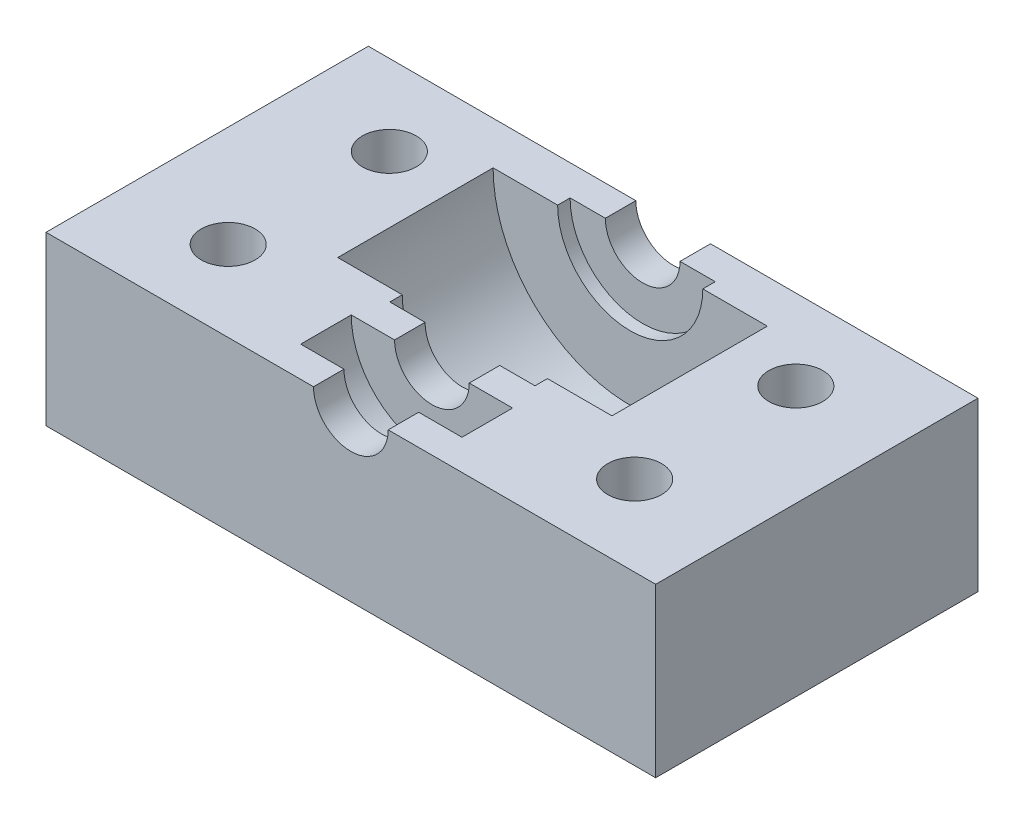
ISO-10303-21;
HEADER;
FILE_DESCRIPTION(('STEP AP214'),'2;1');
FILE_NAME('part.step','',(''),(''),'','','');
FILE_SCHEMA(('AUTOMOTIVE_DESIGN { 1 0 10303 214 1 1 1 1 }'));
ENDSEC;
DATA;
#1=APPLICATION_CONTEXT('core data for automotive mechanical design processes');
#2=APPLICATION_PROTOCOL_DEFINITION('international standard','automotive_design',2000,#1);
#3=PRODUCT_CONTEXT('',#1,'mechanical');
#4=PRODUCT('Part','Part','',(#3));
#5=PRODUCT_RELATED_PRODUCT_CATEGORY('part','',(#4));
#6=PRODUCT_DEFINITION_FORMATION('','',#4);
#7=PRODUCT_DEFINITION_CONTEXT('part definition',#1,'design');
#8=PRODUCT_DEFINITION('design','',#6,#7);
#9=PRODUCT_DEFINITION_SHAPE('','',#8);
#10=(LENGTH_UNIT() NAMED_UNIT(*) SI_UNIT(.MILLI.,.METRE.));
#11=(NAMED_UNIT(*) PLANE_ANGLE_UNIT() SI_UNIT($,.RADIAN.));
#12=(NAMED_UNIT(*) SI_UNIT($,.STERADIAN.) SOLID_ANGLE_UNIT());
#13=UNCERTAINTY_MEASURE_WITH_UNIT(LENGTH_MEASURE(1.E-05),#10,'distance_accuracy_value','');
#14=(GEOMETRIC_REPRESENTATION_CONTEXT(3) GLOBAL_UNCERTAINTY_ASSIGNED_CONTEXT((#13)) GLOBAL_UNIT_ASSIGNED_CONTEXT((#10,
#11,#12)) REPRESENTATION_CONTEXT('',''));
#15=CARTESIAN_POINT('',(0.,0.,0.));
#16=DIRECTION('',(0.,0.,1.));
#17=DIRECTION('',(1.,0.,0.));
#18=AXIS2_PLACEMENT_3D('',#15,#16,#17);
#19=CARTESIAN_POINT('',(0.,-16.49375,0.));
#20=DIRECTION('',(0.,1.,0.));
#21=DIRECTION('',(0.,0.,1.));
#22=AXIS2_PLACEMENT_3D('',#19,#20,#21);
#23=PLANE('',#22);
#24=CARTESIAN_POINT('',(-20.,-16.49375,7.930075));
#25=DIRECTION('',(0.,-1.,0.));
#26=DIRECTION('',(0.,0.,-1.));
#27=AXIS2_PLACEMENT_3D('',#24,#25,#26);
#28=CIRCLE('',#27,2.65);
#29=CARTESIAN_POINT('',(-20.,-16.49375,5.280075));
#30=VERTEX_POINT('',#29);
#31=EDGE_CURVE('E342',#30,#30,#28,.T.);
#32=ORIENTED_EDGE('',*,*,#31,.F.);
#33=EDGE_LOOP('',(#32));
#34=FACE_BOUND('',#33,.T.);
#35=CARTESIAN_POINT('',(20.,-16.49375,-7.930075));
#36=DIRECTION('',(0.,-1.,0.));
#37=DIRECTION('',(0.,0.,-1.));
#38=AXIS2_PLACEMENT_3D('',#35,#36,#37);
#39=CIRCLE('',#38,2.65);
#40=CARTESIAN_POINT('',(20.,-16.49375,-10.580075));
#41=VERTEX_POINT('',#40);
#42=EDGE_CURVE('E192',#41,#41,#39,.T.);
#43=ORIENTED_EDGE('',*,*,#42,.F.);
#44=EDGE_LOOP('',(#43));
#45=FACE_BOUND('',#44,.T.);
#46=CARTESIAN_POINT('',(20.,-16.49375,7.930075));
#47=DIRECTION('',(0.,-1.,0.));
#48=DIRECTION('',(0.,0.,-1.));
#49=AXIS2_PLACEMENT_3D('',#46,#47,#48);
#50=CIRCLE('',#49,2.65);
#51=CARTESIAN_POINT('',(20.,-16.49375,5.280075));
#52=VERTEX_POINT('',#51);
#53=EDGE_CURVE('E199',#52,#52,#50,.T.);
#54=ORIENTED_EDGE('',*,*,#53,.F.);
#55=EDGE_LOOP('',(#54));
#56=FACE_BOUND('',#55,.T.);
#57=DIRECTION('',(1.,0.,0.));
#58=VECTOR('',#57,1.);
#59=CARTESIAN_POINT('',(0.,-16.49375,15.86015));
#60=LINE('',#59,#58);
#61=CARTESIAN_POINT('',(-30.,-16.49375,15.86015));
#62=VERTEX_POINT('',#61);
#63=CARTESIAN_POINT('',(30.,-16.49375,15.86015));
#64=VERTEX_POINT('',#63);
#65=EDGE_CURVE('E229',#62,#64,#60,.T.);
#66=ORIENTED_EDGE('',*,*,#65,.F.);
#67=DIRECTION('',(0.,0.,-1.));
#68=VECTOR('',#67,1.);
#69=CARTESIAN_POINT('',(-30.,-16.49375,0.));
#70=LINE('',#69,#68);
#71=CARTESIAN_POINT('',(-30.,-16.49375,-15.86015));
#72=VERTEX_POINT('',#71);
#73=EDGE_CURVE('E183',#62,#72,#70,.T.);
#74=ORIENTED_EDGE('',*,*,#73,.T.);
#75=DIRECTION('',(1.,0.,0.));
#76=VECTOR('',#75,1.);
#77=CARTESIAN_POINT('',(0.,-16.49375,-15.86015));
#78=LINE('',#77,#76);
#79=CARTESIAN_POINT('',(30.,-16.49375,-15.86015));
#80=VERTEX_POINT('',#79);
#81=EDGE_CURVE('E236',#72,#80,#78,.T.);
#82=ORIENTED_EDGE('',*,*,#81,.T.);
#83=DIRECTION('',(0.,0.,-1.));
#84=VECTOR('',#83,1.);
#85=CARTESIAN_POINT('',(30.,-16.49375,0.));
#86=LINE('',#85,#84);
#87=EDGE_CURVE('E232',#64,#80,#86,.T.);
#88=ORIENTED_EDGE('',*,*,#87,.F.);
#89=EDGE_LOOP('',(#66,#74,#82,#88));
#90=FACE_BOUND('',#89,.T.);
#91=CARTESIAN_POINT('',(-20.,-16.49375,-7.930075));
#92=DIRECTION('',(0.,-1.,0.));
#93=DIRECTION('',(0.,0.,-1.));
#94=AXIS2_PLACEMENT_3D('',#91,#92,#93);
#95=CIRCLE('',#94,2.65);
#96=CARTESIAN_POINT('',(-20.,-16.49375,-10.580075));
#97=VERTEX_POINT('',#96);
#98=EDGE_CURVE('E348',#97,#97,#95,.T.);
#99=ORIENTED_EDGE('',*,*,#98,.F.);
#100=EDGE_LOOP('',(#99));
#101=FACE_BOUND('',#100,.T.);
#102=ADVANCED_FACE('F34',(#34,#45,#56,#90,#101),#23,.F.);
#103=CARTESIAN_POINT('',(0.,-16.49375,15.86015));
#104=DIRECTION('',(0.,0.,1.));
#105=DIRECTION('',(1.,0.,0.));
#106=AXIS2_PLACEMENT_3D('',#103,#104,#105);
#107=PLANE('',#106);
#108=CARTESIAN_POINT('',(0.,0.,15.86015));
#109=DIRECTION('',(0.,0.,-1.));
#110=DIRECTION('',(-1.,0.,0.));
#111=AXIS2_PLACEMENT_3D('',#108,#109,#110);
#112=CIRCLE('',#111,3.675);
#113=CARTESIAN_POINT('',(3.675,0.,15.86015));
#114=VERTEX_POINT('',#113);
#115=CARTESIAN_POINT('',(-3.675,0.,15.86015));
#116=VERTEX_POINT('',#115);
#117=EDGE_CURVE('E54',#114,#116,#112,.T.);
#118=ORIENTED_EDGE('',*,*,#117,.T.);
#119=DIRECTION('',(-1.,0.,0.));
#120=VECTOR('',#119,1.);
#121=CARTESIAN_POINT('',(0.,0.,15.86015));
#122=LINE('',#121,#120);
#123=CARTESIAN_POINT('',(-30.,0.,15.86015));
#124=VERTEX_POINT('',#123);
#125=EDGE_CURVE('E181',#116,#124,#122,.T.);
#126=ORIENTED_EDGE('',*,*,#125,.T.);
#127=DIRECTION('',(0.,1.,0.));
#128=VECTOR('',#127,1.);
#129=CARTESIAN_POINT('',(-30.,-16.49375,15.86015));
#130=LINE('',#129,#128);
#131=EDGE_CURVE('E189',#62,#124,#130,.T.);
#132=ORIENTED_EDGE('',*,*,#131,.F.);
#133=ORIENTED_EDGE('',*,*,#65,.T.);
#134=DIRECTION('',(0.,1.,0.));
#135=VECTOR('',#134,1.);
#136=CARTESIAN_POINT('',(30.,-16.49375,15.86015));
#137=LINE('',#136,#135);
#138=CARTESIAN_POINT('',(30.,0.,15.86015));
#139=VERTEX_POINT('',#138);
#140=EDGE_CURVE('E238',#64,#139,#137,.T.);
#141=ORIENTED_EDGE('',*,*,#140,.T.);
#142=DIRECTION('',(1.,0.,0.));
#143=VECTOR('',#142,1.);
#144=CARTESIAN_POINT('',(0.,0.,15.86015));
#145=LINE('',#144,#143);
#146=EDGE_CURVE('E228',#114,#139,#145,.T.);
#147=ORIENTED_EDGE('',*,*,#146,.F.);
#148=EDGE_LOOP('',(#118,#126,#132,#133,#141,#147));
#149=FACE_BOUND('',#148,.T.);
#150=ADVANCED_FACE('F36',(#149),#107,.T.);
#151=CARTESIAN_POINT('',(0.,-16.49375,-15.86015));
#152=DIRECTION('',(0.,0.,1.));
#153=DIRECTION('',(1.,0.,0.));
#154=AXIS2_PLACEMENT_3D('',#151,#152,#153);
#155=PLANE('',#154);
#156=DIRECTION('',(-1.,0.,0.));
#157=VECTOR('',#156,1.);
#158=CARTESIAN_POINT('',(0.,0.,-15.86015));
#159=LINE('',#158,#157);
#160=CARTESIAN_POINT('',(-3.675,0.,-15.86015));
#161=VERTEX_POINT('',#160);
#162=CARTESIAN_POINT('',(-30.,0.,-15.86015));
#163=VERTEX_POINT('',#162);
#164=EDGE_CURVE('E172',#161,#163,#159,.T.);
#165=ORIENTED_EDGE('',*,*,#164,.F.);
#166=CARTESIAN_POINT('',(0.,0.,-15.86015));
#167=DIRECTION('',(0.,0.,-1.));
#168=DIRECTION('',(-1.,0.,0.));
#169=AXIS2_PLACEMENT_3D('',#166,#167,#168);
#170=CIRCLE('',#169,3.675);
#171=CARTESIAN_POINT('',(3.675,0.,-15.86015));
#172=VERTEX_POINT('',#171);
#173=EDGE_CURVE('E157',#172,#161,#170,.T.);
#174=ORIENTED_EDGE('',*,*,#173,.F.);
#175=DIRECTION('',(1.,0.,0.));
#176=VECTOR('',#175,1.);
#177=CARTESIAN_POINT('',(0.,0.,-15.86015));
#178=LINE('',#177,#176);
#179=CARTESIAN_POINT('',(30.,0.,-15.86015));
#180=VERTEX_POINT('',#179);
#181=EDGE_CURVE('E233',#172,#180,#178,.T.);
#182=ORIENTED_EDGE('',*,*,#181,.T.);
#183=DIRECTION('',(0.,1.,0.));
#184=VECTOR('',#183,1.);
#185=CARTESIAN_POINT('',(30.,-16.49375,-15.86015));
#186=LINE('',#185,#184);
#187=EDGE_CURVE('E244',#80,#180,#186,.T.);
#188=ORIENTED_EDGE('',*,*,#187,.F.);
#189=ORIENTED_EDGE('',*,*,#81,.F.);
#190=DIRECTION('',(0.,1.,0.));
#191=VECTOR('',#190,1.);
#192=CARTESIAN_POINT('',(-30.,-16.49375,-15.86015));
#193=LINE('',#192,#191);
#194=EDGE_CURVE('E178',#72,#163,#193,.T.);
#195=ORIENTED_EDGE('',*,*,#194,.T.);
#196=EDGE_LOOP('',(#165,#174,#182,#188,#189,#195));
#197=FACE_BOUND('',#196,.T.);
#198=ADVANCED_FACE('F176',(#197),#155,.F.);
#199=CARTESIAN_POINT('',(30.,-16.49375,0.));
#200=DIRECTION('',(1.,0.,0.));
#201=DIRECTION('',(0.,0.,-1.));
#202=AXIS2_PLACEMENT_3D('',#199,#200,#201);
#203=PLANE('',#202);
#204=DIRECTION('',(0.,0.,-1.));
#205=VECTOR('',#204,1.);
#206=CARTESIAN_POINT('',(30.,0.,0.));
#207=LINE('',#206,#205);
#208=EDGE_CURVE('E240',#139,#180,#207,.T.);
#209=ORIENTED_EDGE('',*,*,#208,.F.);
#210=ORIENTED_EDGE('',*,*,#140,.F.);
#211=ORIENTED_EDGE('',*,*,#87,.T.);
#212=ORIENTED_EDGE('',*,*,#187,.T.);
#213=EDGE_LOOP('',(#209,#210,#211,#212));
#214=FACE_BOUND('',#213,.T.);
#215=ADVANCED_FACE('F327',(#214),#203,.T.);
#216=CARTESIAN_POINT('',(0.,0.,0.));
#217=DIRECTION('',(0.,1.,0.));
#218=DIRECTION('',(0.,0.,1.));
#219=AXIS2_PLACEMENT_3D('',#216,#217,#218);
#220=PLANE('',#219);
#221=CARTESIAN_POINT('',(20.,0.,-7.930075));
#222=DIRECTION('',(0.,-1.,0.));
#223=DIRECTION('',(0.,0.,-1.));
#224=AXIS2_PLACEMENT_3D('',#221,#222,#223);
#225=CIRCLE('',#224,2.65);
#226=CARTESIAN_POINT('',(20.,0.,-10.580075));
#227=VERTEX_POINT('',#226);
#228=EDGE_CURVE('E196',#227,#227,#225,.T.);
#229=ORIENTED_EDGE('',*,*,#228,.T.);
#230=EDGE_LOOP('',(#229));
#231=FACE_BOUND('',#230,.T.);
#232=CARTESIAN_POINT('',(20.,0.,7.930075));
#233=DIRECTION('',(0.,-1.,0.));
#234=DIRECTION('',(0.,0.,-1.));
#235=AXIS2_PLACEMENT_3D('',#232,#233,#234);
#236=CIRCLE('',#235,2.65);
#237=CARTESIAN_POINT('',(20.,0.,5.280075));
#238=VERTEX_POINT('',#237);
#239=EDGE_CURVE('E167',#238,#238,#236,.T.);
#240=ORIENTED_EDGE('',*,*,#239,.T.);
#241=EDGE_LOOP('',(#240));
#242=FACE_BOUND('',#241,.T.);
#243=DIRECTION('',(0.,0.,-1.));
#244=VECTOR('',#243,1.);
#245=CARTESIAN_POINT('',(3.675,0.,-15.86015));
#246=LINE('',#245,#244);
#247=CARTESIAN_POINT('',(3.675,0.,-12.86015));
#248=VERTEX_POINT('',#247);
#249=EDGE_CURVE('E163',#248,#172,#246,.T.);
#250=ORIENTED_EDGE('',*,*,#249,.F.);
#251=DIRECTION('',(1.,0.,0.));
#252=VECTOR('',#251,1.);
#253=CARTESIAN_POINT('',(0.,0.,-12.86015));
#254=LINE('',#253,#252);
#255=CARTESIAN_POINT('',(7.14375,0.,-12.86015));
#256=VERTEX_POINT('',#255);
#257=EDGE_CURVE('E273',#248,#256,#254,.T.);
#258=ORIENTED_EDGE('',*,*,#257,.T.);
#259=DIRECTION('',(0.,0.,-1.));
#260=VECTOR('',#259,1.);
#261=CARTESIAN_POINT('',(7.14375,0.,-15.86015));
#262=LINE('',#261,#260);
#263=CARTESIAN_POINT('',(7.14375,0.,-11.6346));
#264=VERTEX_POINT('',#263);
#265=EDGE_CURVE('E271',#264,#256,#262,.T.);
#266=ORIENTED_EDGE('',*,*,#265,.F.);
#267=DIRECTION('',(1.,0.,0.));
#268=VECTOR('',#267,1.);
#269=CARTESIAN_POINT('',(0.,0.,-11.6346));
#270=LINE('',#269,#268);
#271=CARTESIAN_POINT('',(13.49375,0.,-11.6346));
#272=VERTEX_POINT('',#271);
#273=EDGE_CURVE('E268',#264,#272,#270,.T.);
#274=ORIENTED_EDGE('',*,*,#273,.T.);
#275=DIRECTION('',(0.,0.,-1.));
#276=VECTOR('',#275,1.);
#277=CARTESIAN_POINT('',(13.49375,0.,-15.86015));
#278=LINE('',#277,#276);
#279=CARTESIAN_POINT('',(13.49375,0.,3.6562));
#280=VERTEX_POINT('',#279);
#281=EDGE_CURVE('E266',#280,#272,#278,.T.);
#282=ORIENTED_EDGE('',*,*,#281,.F.);
#283=DIRECTION('',(1.,0.,0.));
#284=VECTOR('',#283,1.);
#285=CARTESIAN_POINT('',(0.,0.,3.6562));
#286=LINE('',#285,#284);
#287=CARTESIAN_POINT('',(7.14375,0.,3.6562));
#288=VERTEX_POINT('',#287);
#289=EDGE_CURVE('E264',#288,#280,#286,.T.);
#290=ORIENTED_EDGE('',*,*,#289,.F.);
#291=DIRECTION('',(0.,0.,-1.));
#292=VECTOR('',#291,1.);
#293=CARTESIAN_POINT('',(7.14375,0.,-15.86015));
#294=LINE('',#293,#292);
#295=CARTESIAN_POINT('',(7.14375,0.,4.88175));
#296=VERTEX_POINT('',#295);
#297=EDGE_CURVE('E262',#296,#288,#294,.T.);
#298=ORIENTED_EDGE('',*,*,#297,.F.);
#299=DIRECTION('',(1.,0.,0.));
#300=VECTOR('',#299,1.);
#301=CARTESIAN_POINT('',(0.,0.,4.88175));
#302=LINE('',#301,#300);
#303=CARTESIAN_POINT('',(3.675,0.,4.88175));
#304=VERTEX_POINT('',#303);
#305=EDGE_CURVE('E260',#304,#296,#302,.T.);
#306=ORIENTED_EDGE('',*,*,#305,.F.);
#307=DIRECTION('',(0.,0.,-1.));
#308=VECTOR('',#307,1.);
#309=CARTESIAN_POINT('',(3.675,0.,-15.86015));
#310=LINE('',#309,#308);
#311=CARTESIAN_POINT('',(3.675,0.,7.88175));
#312=VERTEX_POINT('',#311);
#313=EDGE_CURVE('E258',#312,#304,#310,.T.);
#314=ORIENTED_EDGE('',*,*,#313,.F.);
#315=DIRECTION('',(1.,0.,0.));
#316=VECTOR('',#315,1.);
#317=CARTESIAN_POINT('',(0.,0.,7.88175));
#318=LINE('',#317,#316);
#319=CARTESIAN_POINT('',(7.9375,0.,7.88175));
#320=VERTEX_POINT('',#319);
#321=EDGE_CURVE('E255',#312,#320,#318,.T.);
#322=ORIENTED_EDGE('',*,*,#321,.T.);
#323=DIRECTION('',(0.,0.,-1.));
#324=VECTOR('',#323,1.);
#325=CARTESIAN_POINT('',(7.9375,0.,-15.86015));
#326=LINE('',#325,#324);
#327=CARTESIAN_POINT('',(7.9375,0.,12.86015));
#328=VERTEX_POINT('',#327);
#329=EDGE_CURVE('E253',#328,#320,#326,.T.);
#330=ORIENTED_EDGE('',*,*,#329,.F.);
#331=DIRECTION('',(1.,0.,0.));
#332=VECTOR('',#331,1.);
#333=CARTESIAN_POINT('',(0.,0.,12.86015));
#334=LINE('',#333,#332);
#335=CARTESIAN_POINT('',(3.675,0.,12.86015));
#336=VERTEX_POINT('',#335);
#337=EDGE_CURVE('E251',#336,#328,#334,.T.);
#338=ORIENTED_EDGE('',*,*,#337,.F.);
#339=DIRECTION('',(0.,0.,-1.));
#340=VECTOR('',#339,1.);
#341=CARTESIAN_POINT('',(3.675,0.,-15.86015));
#342=LINE('',#341,#340);
#343=EDGE_CURVE('E247',#114,#336,#342,.T.);
#344=ORIENTED_EDGE('',*,*,#343,.F.);
#345=ORIENTED_EDGE('',*,*,#146,.T.);
#346=ORIENTED_EDGE('',*,*,#208,.T.);
#347=ORIENTED_EDGE('',*,*,#181,.F.);
#348=EDGE_LOOP('',(#250,#258,#266,#274,#282,#290,#298,#306,#314,#322,#330,#338,#344,#345,#346,#347));
#349=FACE_BOUND('',#348,.T.);
#350=ADVANCED_FACE('F320',(#231,#242,#349),#220,.T.);
#351=CARTESIAN_POINT('',(0.,0.,-15.86015));
#352=DIRECTION('',(0.,0.,-1.));
#353=DIRECTION('',(-1.,0.,0.));
#354=AXIS2_PLACEMENT_3D('',#351,#352,#353);
#355=CYLINDRICAL_SURFACE('',#354,3.675);
#356=ORIENTED_EDGE('',*,*,#173,.T.);
#357=DIRECTION('',(0.,0.,-1.));
#358=VECTOR('',#357,1.);
#359=CARTESIAN_POINT('',(-3.675,0.,-15.86015));
#360=LINE('',#359,#358);
#361=CARTESIAN_POINT('',(-3.675,0.,-12.86015));
#362=VERTEX_POINT('',#361);
#363=EDGE_CURVE('E11',#161,#362,#360,.F.);
#364=ORIENTED_EDGE('',*,*,#363,.T.);
#365=CARTESIAN_POINT('',(0.,0.,-12.86015));
#366=DIRECTION('',(0.,0.,-1.));
#367=DIRECTION('',(-1.,0.,0.));
#368=AXIS2_PLACEMENT_3D('',#365,#366,#367);
#369=CIRCLE('',#368,3.675);
#370=EDGE_CURVE('E226',#248,#362,#369,.T.);
#371=ORIENTED_EDGE('',*,*,#370,.F.);
#372=ORIENTED_EDGE('',*,*,#249,.T.);
#373=EDGE_LOOP('',(#356,#364,#371,#372));
#374=FACE_BOUND('',#373,.T.);
#375=ADVANCED_FACE('F159',(#374),#355,.F.);
#376=CARTESIAN_POINT('',(0.,0.,-12.86015));
#377=DIRECTION('',(0.,0.,1.));
#378=DIRECTION('',(1.,0.,0.));
#379=AXIS2_PLACEMENT_3D('',#376,#377,#378);
#380=PLANE('',#379);
#381=CARTESIAN_POINT('',(0.,0.,-12.86015));
#382=DIRECTION('',(0.,0.,-1.));
#383=DIRECTION('',(-1.,0.,0.));
#384=AXIS2_PLACEMENT_3D('',#381,#382,#383);
#385=CIRCLE('',#384,7.14375);
#386=CARTESIAN_POINT('',(-7.14375,0.,-12.86015));
#387=VERTEX_POINT('',#386);
#388=EDGE_CURVE('E224',#256,#387,#385,.T.);
#389=ORIENTED_EDGE('',*,*,#388,.F.);
#390=ORIENTED_EDGE('',*,*,#257,.F.);
#391=ORIENTED_EDGE('',*,*,#370,.T.);
#392=DIRECTION('',(1.,0.,0.));
#393=VECTOR('',#392,1.);
#394=CARTESIAN_POINT('',(0.,0.,-12.86015));
#395=LINE('',#394,#393);
#396=EDGE_CURVE('E42',#387,#362,#395,.T.);
#397=ORIENTED_EDGE('',*,*,#396,.F.);
#398=EDGE_LOOP('',(#389,#390,#391,#397));
#399=FACE_BOUND('',#398,.T.);
#400=ADVANCED_FACE('F323',(#399),#380,.T.);
#401=CARTESIAN_POINT('',(0.,0.,-15.86015));
#402=DIRECTION('',(0.,0.,-1.));
#403=DIRECTION('',(-1.,0.,0.));
#404=AXIS2_PLACEMENT_3D('',#401,#402,#403);
#405=CYLINDRICAL_SURFACE('',#404,7.14375);
#406=ORIENTED_EDGE('',*,*,#388,.T.);
#407=DIRECTION('',(0.,0.,-1.));
#408=VECTOR('',#407,1.);
#409=CARTESIAN_POINT('',(-7.14375,0.,-15.86015));
#410=LINE('',#409,#408);
#411=CARTESIAN_POINT('',(-7.14375,0.,-11.6346));
#412=VERTEX_POINT('',#411);
#413=EDGE_CURVE('E305',#387,#412,#410,.F.);
#414=ORIENTED_EDGE('',*,*,#413,.T.);
#415=CARTESIAN_POINT('',(0.,0.,-11.6346));
#416=DIRECTION('',(0.,0.,-1.));
#417=DIRECTION('',(-1.,0.,0.));
#418=AXIS2_PLACEMENT_3D('',#415,#416,#417);
#419=CIRCLE('',#418,7.14375);
#420=EDGE_CURVE('E222',#264,#412,#419,.T.);
#421=ORIENTED_EDGE('',*,*,#420,.F.);
#422=ORIENTED_EDGE('',*,*,#265,.T.);
#423=EDGE_LOOP('',(#406,#414,#421,#422));
#424=FACE_BOUND('',#423,.T.);
#425=ADVANCED_FACE('F309',(#424),#405,.F.);
#426=CARTESIAN_POINT('',(0.,0.,-11.6346));
#427=DIRECTION('',(0.,0.,1.));
#428=DIRECTION('',(1.,0.,0.));
#429=AXIS2_PLACEMENT_3D('',#426,#427,#428);
#430=PLANE('',#429);
#431=CARTESIAN_POINT('',(0.,0.,-11.6346));
#432=DIRECTION('',(0.,0.,-1.));
#433=DIRECTION('',(-1.,0.,0.));
#434=AXIS2_PLACEMENT_3D('',#431,#432,#433);
#435=CIRCLE('',#434,13.49375);
#436=CARTESIAN_POINT('',(-13.49375,0.,-11.6346));
#437=VERTEX_POINT('',#436);
#438=EDGE_CURVE('E220',#272,#437,#435,.T.);
#439=ORIENTED_EDGE('',*,*,#438,.F.);
#440=ORIENTED_EDGE('',*,*,#273,.F.);
#441=ORIENTED_EDGE('',*,*,#420,.T.);
#442=DIRECTION('',(1.,0.,0.));
#443=VECTOR('',#442,1.);
#444=CARTESIAN_POINT('',(0.,0.,-11.6346));
#445=LINE('',#444,#443);
#446=EDGE_CURVE('E302',#437,#412,#445,.T.);
#447=ORIENTED_EDGE('',*,*,#446,.F.);
#448=EDGE_LOOP('',(#439,#440,#441,#447));
#449=FACE_BOUND('',#448,.T.);
#450=ADVANCED_FACE('F317',(#449),#430,.T.);
#451=CARTESIAN_POINT('',(0.,0.,-15.86015));
#452=DIRECTION('',(0.,0.,-1.));
#453=DIRECTION('',(-1.,0.,0.));
#454=AXIS2_PLACEMENT_3D('',#451,#452,#453);
#455=CYLINDRICAL_SURFACE('',#454,13.49375);
#456=ORIENTED_EDGE('',*,*,#438,.T.);
#457=DIRECTION('',(0.,0.,-1.));
#458=VECTOR('',#457,1.);
#459=CARTESIAN_POINT('',(-13.49375,0.,-15.86015));
#460=LINE('',#459,#458);
#461=CARTESIAN_POINT('',(-13.49375,0.,3.6562));
#462=VERTEX_POINT('',#461);
#463=EDGE_CURVE('E299',#437,#462,#460,.F.);
#464=ORIENTED_EDGE('',*,*,#463,.T.);
#465=CARTESIAN_POINT('',(0.,0.,3.6562));
#466=DIRECTION('',(0.,0.,-1.));
#467=DIRECTION('',(-1.,0.,0.));
#468=AXIS2_PLACEMENT_3D('',#465,#466,#467);
#469=CIRCLE('',#468,13.49375);
#470=EDGE_CURVE('E218',#280,#462,#469,.T.);
#471=ORIENTED_EDGE('',*,*,#470,.F.);
#472=ORIENTED_EDGE('',*,*,#281,.T.);
#473=EDGE_LOOP('',(#456,#464,#471,#472));
#474=FACE_BOUND('',#473,.T.);
#475=ADVANCED_FACE('F400',(#474),#455,.F.);
#476=CARTESIAN_POINT('',(0.,0.,3.6562));
#477=DIRECTION('',(0.,0.,1.));
#478=DIRECTION('',(1.,0.,0.));
#479=AXIS2_PLACEMENT_3D('',#476,#477,#478);
#480=PLANE('',#479);
#481=ORIENTED_EDGE('',*,*,#470,.T.);
#482=DIRECTION('',(1.,0.,0.));
#483=VECTOR('',#482,1.);
#484=CARTESIAN_POINT('',(0.,0.,3.6562));
#485=LINE('',#484,#483);
#486=CARTESIAN_POINT('',(-7.14375,0.,3.6562));
#487=VERTEX_POINT('',#486);
#488=EDGE_CURVE('E296',#462,#487,#485,.T.);
#489=ORIENTED_EDGE('',*,*,#488,.T.);
#490=CARTESIAN_POINT('',(0.,0.,3.6562));
#491=DIRECTION('',(0.,0.,-1.));
#492=DIRECTION('',(-1.,0.,0.));
#493=AXIS2_PLACEMENT_3D('',#490,#491,#492);
#494=CIRCLE('',#493,7.14375);
#495=EDGE_CURVE('E216',#288,#487,#494,.T.);
#496=ORIENTED_EDGE('',*,*,#495,.F.);
#497=ORIENTED_EDGE('',*,*,#289,.T.);
#498=EDGE_LOOP('',(#481,#489,#496,#497));
#499=FACE_BOUND('',#498,.T.);
#500=ADVANCED_FACE('F407',(#499),#480,.F.);
#501=CARTESIAN_POINT('',(0.,0.,-15.86015));
#502=DIRECTION('',(0.,0.,-1.));
#503=DIRECTION('',(-1.,0.,0.));
#504=AXIS2_PLACEMENT_3D('',#501,#502,#503);
#505=CYLINDRICAL_SURFACE('',#504,7.14375);
#506=ORIENTED_EDGE('',*,*,#495,.T.);
#507=DIRECTION('',(0.,0.,-1.));
#508=VECTOR('',#507,1.);
#509=CARTESIAN_POINT('',(-7.14375,0.,-15.86015));
#510=LINE('',#509,#508);
#511=CARTESIAN_POINT('',(-7.14375,0.,4.88175));
#512=VERTEX_POINT('',#511);
#513=EDGE_CURVE('E293',#487,#512,#510,.F.);
#514=ORIENTED_EDGE('',*,*,#513,.T.);
#515=CARTESIAN_POINT('',(0.,0.,4.88175));
#516=DIRECTION('',(0.,0.,-1.));
#517=DIRECTION('',(-1.,0.,0.));
#518=AXIS2_PLACEMENT_3D('',#515,#516,#517);
#519=CIRCLE('',#518,7.14375);
#520=EDGE_CURVE('E214',#296,#512,#519,.T.);
#521=ORIENTED_EDGE('',*,*,#520,.F.);
#522=ORIENTED_EDGE('',*,*,#297,.T.);
#523=EDGE_LOOP('',(#506,#514,#521,#522));
#524=FACE_BOUND('',#523,.T.);
#525=ADVANCED_FACE('F415',(#524),#505,.F.);
#526=CARTESIAN_POINT('',(0.,0.,4.88175));
#527=DIRECTION('',(0.,0.,1.));
#528=DIRECTION('',(1.,0.,0.));
#529=AXIS2_PLACEMENT_3D('',#526,#527,#528);
#530=PLANE('',#529);
#531=ORIENTED_EDGE('',*,*,#520,.T.);
#532=DIRECTION('',(1.,0.,0.));
#533=VECTOR('',#532,1.);
#534=CARTESIAN_POINT('',(0.,0.,4.88175));
#535=LINE('',#534,#533);
#536=CARTESIAN_POINT('',(-3.675,0.,4.88175));
#537=VERTEX_POINT('',#536);
#538=EDGE_CURVE('E290',#512,#537,#535,.T.);
#539=ORIENTED_EDGE('',*,*,#538,.T.);
#540=CARTESIAN_POINT('',(0.,0.,4.88175));
#541=DIRECTION('',(0.,0.,-1.));
#542=DIRECTION('',(-1.,0.,0.));
#543=AXIS2_PLACEMENT_3D('',#540,#541,#542);
#544=CIRCLE('',#543,3.675);
#545=EDGE_CURVE('E212',#304,#537,#544,.T.);
#546=ORIENTED_EDGE('',*,*,#545,.F.);
#547=ORIENTED_EDGE('',*,*,#305,.T.);
#548=EDGE_LOOP('',(#531,#539,#546,#547));
#549=FACE_BOUND('',#548,.T.);
#550=ADVANCED_FACE('F423',(#549),#530,.F.);
#551=CARTESIAN_POINT('',(0.,0.,-15.86015));
#552=DIRECTION('',(0.,0.,-1.));
#553=DIRECTION('',(-1.,0.,0.));
#554=AXIS2_PLACEMENT_3D('',#551,#552,#553);
#555=CYLINDRICAL_SURFACE('',#554,3.675);
#556=ORIENTED_EDGE('',*,*,#545,.T.);
#557=DIRECTION('',(0.,0.,-1.));
#558=VECTOR('',#557,1.);
#559=CARTESIAN_POINT('',(-3.675,0.,-15.86015));
#560=LINE('',#559,#558);
#561=CARTESIAN_POINT('',(-3.675,0.,7.88175));
#562=VERTEX_POINT('',#561);
#563=EDGE_CURVE('E287',#537,#562,#560,.F.);
#564=ORIENTED_EDGE('',*,*,#563,.T.);
#565=CARTESIAN_POINT('',(0.,0.,7.88175));
#566=DIRECTION('',(0.,0.,-1.));
#567=DIRECTION('',(-1.,0.,0.));
#568=AXIS2_PLACEMENT_3D('',#565,#566,#567);
#569=CIRCLE('',#568,3.675);
#570=EDGE_CURVE('E210',#312,#562,#569,.T.);
#571=ORIENTED_EDGE('',*,*,#570,.F.);
#572=ORIENTED_EDGE('',*,*,#313,.T.);
#573=EDGE_LOOP('',(#556,#564,#571,#572));
#574=FACE_BOUND('',#573,.T.);
#575=ADVANCED_FACE('F431',(#574),#555,.F.);
#576=CARTESIAN_POINT('',(0.,0.,7.88175));
#577=DIRECTION('',(0.,0.,1.));
#578=DIRECTION('',(1.,0.,0.));
#579=AXIS2_PLACEMENT_3D('',#576,#577,#578);
#580=PLANE('',#579);
#581=CARTESIAN_POINT('',(0.,0.,7.88175));
#582=DIRECTION('',(0.,0.,-1.));
#583=DIRECTION('',(-1.,0.,0.));
#584=AXIS2_PLACEMENT_3D('',#581,#582,#583);
#585=CIRCLE('',#584,7.9375);
#586=CARTESIAN_POINT('',(-7.9375,0.,7.88175));
#587=VERTEX_POINT('',#586);
#588=EDGE_CURVE('E208',#320,#587,#585,.T.);
#589=ORIENTED_EDGE('',*,*,#588,.F.);
#590=ORIENTED_EDGE('',*,*,#321,.F.);
#591=ORIENTED_EDGE('',*,*,#570,.T.);
#592=DIRECTION('',(1.,0.,0.));
#593=VECTOR('',#592,1.);
#594=CARTESIAN_POINT('',(0.,0.,7.88175));
#595=LINE('',#594,#593);
#596=EDGE_CURVE('E284',#587,#562,#595,.T.);
#597=ORIENTED_EDGE('',*,*,#596,.F.);
#598=EDGE_LOOP('',(#589,#590,#591,#597));
#599=FACE_BOUND('',#598,.T.);
#600=ADVANCED_FACE('F439',(#599),#580,.T.);
#601=CARTESIAN_POINT('',(0.,0.,-15.86015));
#602=DIRECTION('',(0.,0.,-1.));
#603=DIRECTION('',(-1.,0.,0.));
#604=AXIS2_PLACEMENT_3D('',#601,#602,#603);
#605=CYLINDRICAL_SURFACE('',#604,7.9375);
#606=ORIENTED_EDGE('',*,*,#588,.T.);
#607=DIRECTION('',(0.,0.,-1.));
#608=VECTOR('',#607,1.);
#609=CARTESIAN_POINT('',(-7.9375,0.,-15.86015));
#610=LINE('',#609,#608);
#611=CARTESIAN_POINT('',(-7.9375,0.,12.86015));
#612=VERTEX_POINT('',#611);
#613=EDGE_CURVE('E281',#587,#612,#610,.F.);
#614=ORIENTED_EDGE('',*,*,#613,.T.);
#615=CARTESIAN_POINT('',(0.,0.,12.86015));
#616=DIRECTION('',(0.,0.,-1.));
#617=DIRECTION('',(-1.,0.,0.));
#618=AXIS2_PLACEMENT_3D('',#615,#616,#617);
#619=CIRCLE('',#618,7.9375);
#620=EDGE_CURVE('E206',#328,#612,#619,.T.);
#621=ORIENTED_EDGE('',*,*,#620,.F.);
#622=ORIENTED_EDGE('',*,*,#329,.T.);
#623=EDGE_LOOP('',(#606,#614,#621,#622));
#624=FACE_BOUND('',#623,.T.);
#625=ADVANCED_FACE('F447',(#624),#605,.F.);
#626=CARTESIAN_POINT('',(0.,0.,12.86015));
#627=DIRECTION('',(0.,0.,1.));
#628=DIRECTION('',(1.,0.,0.));
#629=AXIS2_PLACEMENT_3D('',#626,#627,#628);
#630=PLANE('',#629);
#631=ORIENTED_EDGE('',*,*,#620,.T.);
#632=DIRECTION('',(1.,0.,0.));
#633=VECTOR('',#632,1.);
#634=CARTESIAN_POINT('',(0.,0.,12.86015));
#635=LINE('',#634,#633);
#636=CARTESIAN_POINT('',(-3.675,0.,12.86015));
#637=VERTEX_POINT('',#636);
#638=EDGE_CURVE('E279',#612,#637,#635,.T.);
#639=ORIENTED_EDGE('',*,*,#638,.T.);
#640=CARTESIAN_POINT('',(0.,0.,12.86015));
#641=DIRECTION('',(0.,0.,-1.));
#642=DIRECTION('',(-1.,0.,0.));
#643=AXIS2_PLACEMENT_3D('',#640,#641,#642);
#644=CIRCLE('',#643,3.675);
#645=EDGE_CURVE('E49',#336,#637,#644,.T.);
#646=ORIENTED_EDGE('',*,*,#645,.F.);
#647=ORIENTED_EDGE('',*,*,#337,.T.);
#648=EDGE_LOOP('',(#631,#639,#646,#647));
#649=FACE_BOUND('',#648,.T.);
#650=ADVANCED_FACE('F455',(#649),#630,.F.);
#651=CARTESIAN_POINT('',(0.,0.,-15.86015));
#652=DIRECTION('',(0.,0.,-1.));
#653=DIRECTION('',(-1.,0.,0.));
#654=AXIS2_PLACEMENT_3D('',#651,#652,#653);
#655=CYLINDRICAL_SURFACE('',#654,3.675);
#656=ORIENTED_EDGE('',*,*,#645,.T.);
#657=DIRECTION('',(0.,0.,-1.));
#658=VECTOR('',#657,1.);
#659=CARTESIAN_POINT('',(-3.675,0.,-15.86015));
#660=LINE('',#659,#658);
#661=EDGE_CURVE('E277',#637,#116,#660,.F.);
#662=ORIENTED_EDGE('',*,*,#661,.T.);
#663=ORIENTED_EDGE('',*,*,#117,.F.);
#664=ORIENTED_EDGE('',*,*,#343,.T.);
#665=EDGE_LOOP('',(#656,#662,#663,#664));
#666=FACE_BOUND('',#665,.T.);
#667=ADVANCED_FACE('F463',(#666),#655,.F.);
#668=CARTESIAN_POINT('',(20.,-16.49375,7.930075));
#669=DIRECTION('',(0.,-1.,0.));
#670=DIRECTION('',(0.,0.,-1.));
#671=AXIS2_PLACEMENT_3D('',#668,#669,#670);
#672=CYLINDRICAL_SURFACE('',#671,2.65);
#673=ORIENTED_EDGE('',*,*,#239,.F.);
#674=EDGE_LOOP('',(#673));
#675=FACE_BOUND('',#674,.T.);
#676=ORIENTED_EDGE('',*,*,#53,.T.);
#677=EDGE_LOOP('',(#676));
#678=FACE_BOUND('',#677,.T.);
#679=ADVANCED_FACE('F471',(#675,#678),#672,.F.);
#680=CARTESIAN_POINT('',(20.,-16.49375,-7.930075));
#681=DIRECTION('',(0.,-1.,0.));
#682=DIRECTION('',(0.,0.,-1.));
#683=AXIS2_PLACEMENT_3D('',#680,#681,#682);
#684=CYLINDRICAL_SURFACE('',#683,2.65);
#685=ORIENTED_EDGE('',*,*,#228,.F.);
#686=EDGE_LOOP('',(#685));
#687=FACE_BOUND('',#686,.T.);
#688=ORIENTED_EDGE('',*,*,#42,.T.);
#689=EDGE_LOOP('',(#688));
#690=FACE_BOUND('',#689,.T.);
#691=ADVANCED_FACE('F478',(#687,#690),#684,.F.);
#692=CARTESIAN_POINT('',(-30.,-16.49375,0.));
#693=DIRECTION('',(1.,0.,0.));
#694=DIRECTION('',(0.,0.,-1.));
#695=AXIS2_PLACEMENT_3D('',#692,#693,#694);
#696=PLANE('',#695);
#697=DIRECTION('',(0.,0.,-1.));
#698=VECTOR('',#697,1.);
#699=CARTESIAN_POINT('',(-30.,0.,0.));
#700=LINE('',#699,#698);
#701=EDGE_CURVE('E180',#124,#163,#700,.T.);
#702=ORIENTED_EDGE('',*,*,#701,.T.);
#703=ORIENTED_EDGE('',*,*,#194,.F.);
#704=ORIENTED_EDGE('',*,*,#73,.F.);
#705=ORIENTED_EDGE('',*,*,#131,.T.);
#706=EDGE_LOOP('',(#702,#703,#704,#705));
#707=FACE_BOUND('',#706,.T.);
#708=ADVANCED_FACE('F338',(#707),#696,.F.);
#709=CARTESIAN_POINT('',(0.,0.,0.));
#710=DIRECTION('',(0.,1.,0.));
#711=DIRECTION('',(0.,0.,1.));
#712=AXIS2_PLACEMENT_3D('',#709,#710,#711);
#713=PLANE('',#712);
#714=CARTESIAN_POINT('',(-20.,0.,-7.930075));
#715=DIRECTION('',(0.,-1.,0.));
#716=DIRECTION('',(0.,0.,-1.));
#717=AXIS2_PLACEMENT_3D('',#714,#715,#716);
#718=CIRCLE('',#717,2.65);
#719=CARTESIAN_POINT('',(-20.,0.,-10.580075));
#720=VERTEX_POINT('',#719);
#721=EDGE_CURVE('E345',#720,#720,#718,.T.);
#722=ORIENTED_EDGE('',*,*,#721,.T.);
#723=EDGE_LOOP('',(#722));
#724=FACE_BOUND('',#723,.T.);
#725=CARTESIAN_POINT('',(-20.,0.,7.930075));
#726=DIRECTION('',(0.,-1.,0.));
#727=DIRECTION('',(0.,0.,-1.));
#728=AXIS2_PLACEMENT_3D('',#725,#726,#727);
#729=CIRCLE('',#728,2.65);
#730=CARTESIAN_POINT('',(-20.,0.,5.280075));
#731=VERTEX_POINT('',#730);
#732=EDGE_CURVE('E185',#731,#731,#729,.T.);
#733=ORIENTED_EDGE('',*,*,#732,.T.);
#734=EDGE_LOOP('',(#733));
#735=FACE_BOUND('',#734,.T.);
#736=ORIENTED_EDGE('',*,*,#363,.F.);
#737=ORIENTED_EDGE('',*,*,#164,.T.);
#738=ORIENTED_EDGE('',*,*,#701,.F.);
#739=ORIENTED_EDGE('',*,*,#125,.F.);
#740=ORIENTED_EDGE('',*,*,#661,.F.);
#741=ORIENTED_EDGE('',*,*,#638,.F.);
#742=ORIENTED_EDGE('',*,*,#613,.F.);
#743=ORIENTED_EDGE('',*,*,#596,.T.);
#744=ORIENTED_EDGE('',*,*,#563,.F.);
#745=ORIENTED_EDGE('',*,*,#538,.F.);
#746=ORIENTED_EDGE('',*,*,#513,.F.);
#747=ORIENTED_EDGE('',*,*,#488,.F.);
#748=ORIENTED_EDGE('',*,*,#463,.F.);
#749=ORIENTED_EDGE('',*,*,#446,.T.);
#750=ORIENTED_EDGE('',*,*,#413,.F.);
#751=ORIENTED_EDGE('',*,*,#396,.T.);
#752=EDGE_LOOP('',(#736,#737,#738,#739,#740,#741,#742,#743,#744,#745,#746,#747,#748,#749,#750,#751));
#753=FACE_BOUND('',#752,.T.);
#754=ADVANCED_FACE('F170',(#724,#735,#753),#713,.T.);
#755=CARTESIAN_POINT('',(-20.,-16.49375,7.930075));
#756=DIRECTION('',(0.,-1.,0.));
#757=DIRECTION('',(0.,0.,-1.));
#758=AXIS2_PLACEMENT_3D('',#755,#756,#757);
#759=CYLINDRICAL_SURFACE('',#758,2.65);
#760=ORIENTED_EDGE('',*,*,#732,.F.);
#761=EDGE_LOOP('',(#760));
#762=FACE_BOUND('',#761,.T.);
#763=ORIENTED_EDGE('',*,*,#31,.T.);
#764=EDGE_LOOP('',(#763));
#765=FACE_BOUND('',#764,.T.);
#766=ADVANCED_FACE('F498',(#762,#765),#759,.F.);
#767=CARTESIAN_POINT('',(-20.,-16.49375,-7.930075));
#768=DIRECTION('',(0.,-1.,0.));
#769=DIRECTION('',(0.,0.,-1.));
#770=AXIS2_PLACEMENT_3D('',#767,#768,#769);
#771=CYLINDRICAL_SURFACE('',#770,2.65);
#772=ORIENTED_EDGE('',*,*,#721,.F.);
#773=EDGE_LOOP('',(#772));
#774=FACE_BOUND('',#773,.T.);
#775=ORIENTED_EDGE('',*,*,#98,.T.);
#776=EDGE_LOOP('',(#775));
#777=FACE_BOUND('',#776,.T.);
#778=ADVANCED_FACE('F352',(#774,#777),#771,.F.);
#779=CLOSED_SHELL('',(#102,#150,#198,#215,#350,#375,#400,#425,#450,#475,#500,#525,#550,#575,
#600,#625,#650,#667,#679,#691,#708,#754,#766,#778));
#780=MANIFOLD_SOLID_BREP('B2',#779);
#781=ADVANCED_BREP_SHAPE_REPRESENTATION('',(#18,#780),#14);
#782=SHAPE_DEFINITION_REPRESENTATION(#9,#781);
ENDSEC;
END-ISO-10303-21;
